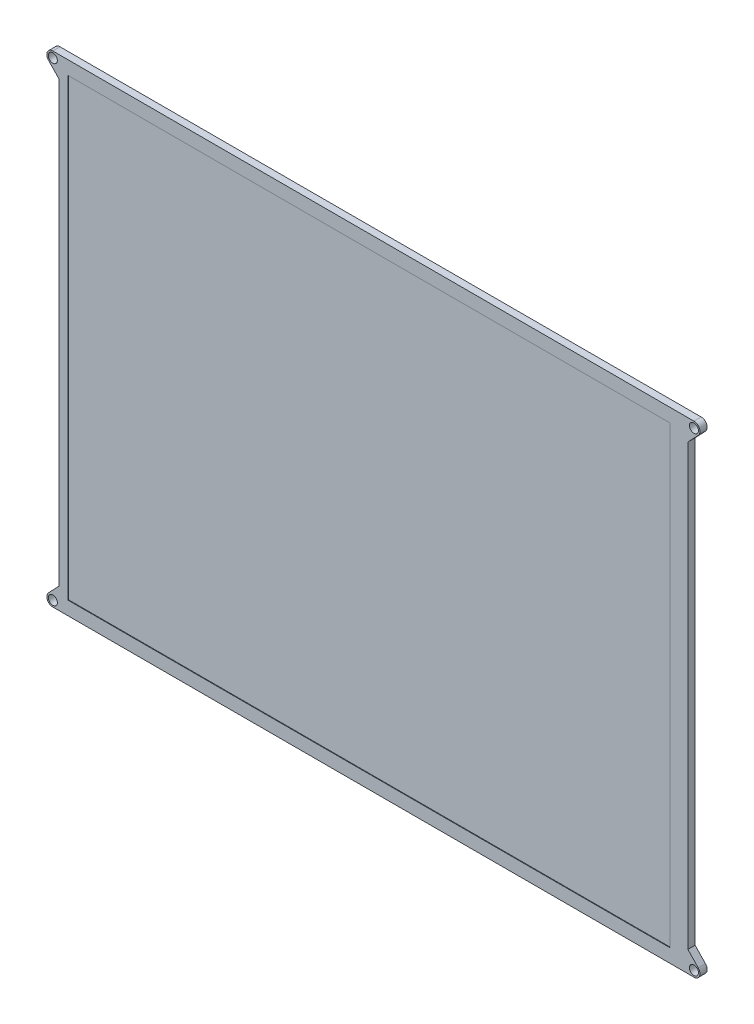
ISO-10303-21;
HEADER;
FILE_DESCRIPTION(('STEP AP214'),'2;1');
FILE_NAME('part.step','',(''),(''),'','','');
FILE_SCHEMA(('AUTOMOTIVE_DESIGN { 1 0 10303 214 1 1 1 1 }'));
ENDSEC;
DATA;
#1=APPLICATION_CONTEXT('core data for automotive mechanical design processes');
#2=APPLICATION_PROTOCOL_DEFINITION('international standard','automotive_design',2000,#1);
#3=PRODUCT_CONTEXT('',#1,'mechanical');
#4=PRODUCT('Part','Part','',(#3));
#5=PRODUCT_RELATED_PRODUCT_CATEGORY('part','',(#4));
#6=PRODUCT_DEFINITION_FORMATION('','',#4);
#7=PRODUCT_DEFINITION_CONTEXT('part definition',#1,'design');
#8=PRODUCT_DEFINITION('design','',#6,#7);
#9=PRODUCT_DEFINITION_SHAPE('','',#8);
#10=(LENGTH_UNIT() NAMED_UNIT(*) SI_UNIT(.MILLI.,.METRE.));
#11=(NAMED_UNIT(*) PLANE_ANGLE_UNIT() SI_UNIT($,.RADIAN.));
#12=(NAMED_UNIT(*) SI_UNIT($,.STERADIAN.) SOLID_ANGLE_UNIT());
#13=UNCERTAINTY_MEASURE_WITH_UNIT(LENGTH_MEASURE(1.E-05),#10,'distance_accuracy_value','');
#14=(GEOMETRIC_REPRESENTATION_CONTEXT(3) GLOBAL_UNCERTAINTY_ASSIGNED_CONTEXT((#13)) GLOBAL_UNIT_ASSIGNED_CONTEXT((#10,
#11,#12)) REPRESENTATION_CONTEXT('',''));
#15=CARTESIAN_POINT('',(0.,0.,0.));
#16=DIRECTION('',(0.,0.,1.));
#17=DIRECTION('',(1.,0.,0.));
#18=AXIS2_PLACEMENT_3D('',#15,#16,#17);
#19=CARTESIAN_POINT('',(104.5,0.,2.4));
#20=DIRECTION('',(1.,0.,0.));
#21=DIRECTION('',(0.,0.,-1.));
#22=AXIS2_PLACEMENT_3D('',#19,#20,#21);
#23=PLANE('',#22);
#24=DIRECTION('',(0.,-1.,0.));
#25=VECTOR('',#24,1.);
#26=CARTESIAN_POINT('',(104.5,0.,0.));
#27=LINE('',#26,#25);
#28=CARTESIAN_POINT('',(104.5,73.0000000000001,0.));
#29=VERTEX_POINT('',#28);
#30=CARTESIAN_POINT('',(104.5,-73.0000000000001,0.));
#31=VERTEX_POINT('',#30);
#32=EDGE_CURVE('E177',#29,#31,#27,.T.);
#33=ORIENTED_EDGE('',*,*,#32,.F.);
#34=DIRECTION('',(0.,0.,-1.));
#35=VECTOR('',#34,1.);
#36=CARTESIAN_POINT('',(104.5,73.0000000000001,2.4));
#37=LINE('',#36,#35);
#38=CARTESIAN_POINT('',(104.5,73.0000000000001,2.4));
#39=VERTEX_POINT('',#38);
#40=EDGE_CURVE('E11',#39,#29,#37,.T.);
#41=ORIENTED_EDGE('',*,*,#40,.F.);
#42=DIRECTION('',(0.,-1.,0.));
#43=VECTOR('',#42,1.);
#44=CARTESIAN_POINT('',(104.5,0.,2.4));
#45=LINE('',#44,#43);
#46=CARTESIAN_POINT('',(104.5,-73.0000000000001,2.4));
#47=VERTEX_POINT('',#46);
#48=EDGE_CURVE('E218',#39,#47,#45,.T.);
#49=ORIENTED_EDGE('',*,*,#48,.T.);
#50=DIRECTION('',(0.,0.,-1.));
#51=VECTOR('',#50,1.);
#52=CARTESIAN_POINT('',(104.5,-73.0000000000001,2.4));
#53=LINE('',#52,#51);
#54=EDGE_CURVE('E56',#47,#31,#53,.T.);
#55=ORIENTED_EDGE('',*,*,#54,.T.);
#56=EDGE_LOOP('',(#33,#41,#49,#55));
#57=FACE_BOUND('',#56,.T.);
#58=ADVANCED_FACE('F33',(#57),#23,.T.);
#59=CARTESIAN_POINT('',(18.3406658739592,-17.4673008323422,2.4));
#60=DIRECTION('',(-0.724137931034481,0.689655172413795,0.));
#61=DIRECTION('',(-0.689655172413795,-0.724137931034481,0.));
#62=AXIS2_PLACEMENT_3D('',#59,#60,#61);
#63=PLANE('',#62);
#64=DIRECTION('',(0.689655172413795,0.724137931034481,0.));
#65=VECTOR('',#64,1.);
#66=CARTESIAN_POINT('',(18.3406658739592,-17.4673008323422,0.));
#67=LINE('',#66,#65);
#68=CARTESIAN_POINT('',(107.948275862069,76.6206896551725,0.));
#69=VERTEX_POINT('',#68);
#70=EDGE_CURVE('E179',#29,#69,#67,.T.);
#71=ORIENTED_EDGE('',*,*,#70,.T.);
#72=DIRECTION('',(0.,0.,-1.));
#73=VECTOR('',#72,1.);
#74=CARTESIAN_POINT('',(107.948275862069,76.6206896551725,2.4));
#75=LINE('',#74,#73);
#76=CARTESIAN_POINT('',(107.948275862069,76.6206896551725,2.4));
#77=VERTEX_POINT('',#76);
#78=EDGE_CURVE('E40',#77,#69,#75,.T.);
#79=ORIENTED_EDGE('',*,*,#78,.F.);
#80=DIRECTION('',(0.689655172413795,0.724137931034481,0.));
#81=VECTOR('',#80,1.);
#82=CARTESIAN_POINT('',(18.3406658739592,-17.4673008323422,2.4));
#83=LINE('',#82,#81);
#84=EDGE_CURVE('E261',#39,#77,#83,.T.);
#85=ORIENTED_EDGE('',*,*,#84,.F.);
#86=ORIENTED_EDGE('',*,*,#40,.T.);
#87=EDGE_LOOP('',(#71,#79,#85,#86));
#88=FACE_BOUND('',#87,.T.);
#89=ADVANCED_FACE('F354',(#88),#63,.F.);
#90=CARTESIAN_POINT('',(106.5,78.,2.4));
#91=DIRECTION('',(0.,0.,-1.));
#92=DIRECTION('',(-1.,0.,0.));
#93=AXIS2_PLACEMENT_3D('',#90,#91,#92);
#94=CYLINDRICAL_SURFACE('',#93,1.99999999999998);
#95=CARTESIAN_POINT('',(106.5,78.,0.));
#96=DIRECTION('',(0.,0.,1.));
#97=DIRECTION('',(1.,0.,0.));
#98=AXIS2_PLACEMENT_3D('',#95,#96,#97);
#99=CIRCLE('',#98,1.99999999999998);
#100=CARTESIAN_POINT('',(106.5,80.,0.));
#101=VERTEX_POINT('',#100);
#102=EDGE_CURVE('E182',#69,#101,#99,.T.);
#103=ORIENTED_EDGE('',*,*,#102,.T.);
#104=DIRECTION('',(0.,0.,-1.));
#105=VECTOR('',#104,1.);
#106=CARTESIAN_POINT('',(106.5,80.,2.4));
#107=LINE('',#106,#105);
#108=CARTESIAN_POINT('',(106.5,80.,2.4));
#109=VERTEX_POINT('',#108);
#110=EDGE_CURVE('E234',#109,#101,#107,.T.);
#111=ORIENTED_EDGE('',*,*,#110,.F.);
#112=CARTESIAN_POINT('',(106.5,78.,2.4));
#113=DIRECTION('',(0.,0.,1.));
#114=DIRECTION('',(1.,0.,0.));
#115=AXIS2_PLACEMENT_3D('',#112,#113,#114);
#116=CIRCLE('',#115,1.99999999999998);
#117=EDGE_CURVE('E242',#77,#109,#116,.T.);
#118=ORIENTED_EDGE('',*,*,#117,.F.);
#119=ORIENTED_EDGE('',*,*,#78,.T.);
#120=EDGE_LOOP('',(#103,#111,#118,#119));
#121=FACE_BOUND('',#120,.T.);
#122=ADVANCED_FACE('F240',(#121),#94,.T.);
#123=CARTESIAN_POINT('',(0.,80.,2.4));
#124=DIRECTION('',(0.,1.,0.));
#125=DIRECTION('',(0.,0.,1.));
#126=AXIS2_PLACEMENT_3D('',#123,#124,#125);
#127=PLANE('',#126);
#128=DIRECTION('',(1.,0.,0.));
#129=VECTOR('',#128,1.);
#130=CARTESIAN_POINT('',(0.,80.,0.));
#131=LINE('',#130,#129);
#132=CARTESIAN_POINT('',(-106.5,79.9999999999985,0.));
#133=VERTEX_POINT('',#132);
#134=EDGE_CURVE('E185',#133,#101,#131,.T.);
#135=ORIENTED_EDGE('',*,*,#134,.F.);
#136=DIRECTION('',(0.,0.,-1.));
#137=VECTOR('',#136,1.);
#138=CARTESIAN_POINT('',(-106.5,79.9999999999985,2.4));
#139=LINE('',#138,#137);
#140=CARTESIAN_POINT('',(-106.5,79.9999999999985,2.4));
#141=VERTEX_POINT('',#140);
#142=EDGE_CURVE('E232',#141,#133,#139,.T.);
#143=ORIENTED_EDGE('',*,*,#142,.F.);
#144=DIRECTION('',(1.,0.,0.));
#145=VECTOR('',#144,1.);
#146=CARTESIAN_POINT('',(0.,80.,2.4));
#147=LINE('',#146,#145);
#148=EDGE_CURVE('E254',#141,#109,#147,.T.);
#149=ORIENTED_EDGE('',*,*,#148,.T.);
#150=ORIENTED_EDGE('',*,*,#110,.T.);
#151=EDGE_LOOP('',(#135,#143,#149,#150));
#152=FACE_BOUND('',#151,.T.);
#153=ADVANCED_FACE('F251',(#152),#127,.T.);
#154=CARTESIAN_POINT('',(-106.5,78.,2.4));
#155=DIRECTION('',(0.,0.,-1.));
#156=DIRECTION('',(-1.,0.,0.));
#157=AXIS2_PLACEMENT_3D('',#154,#155,#156);
#158=CYLINDRICAL_SURFACE('',#157,1.99999999999975);
#159=CARTESIAN_POINT('',(-106.5,78.,0.));
#160=DIRECTION('',(0.,0.,1.));
#161=DIRECTION('',(1.,0.,0.));
#162=AXIS2_PLACEMENT_3D('',#159,#160,#161);
#163=CIRCLE('',#162,1.99999999999975);
#164=CARTESIAN_POINT('',(-107.948275862069,76.6206896551709,0.));
#165=VERTEX_POINT('',#164);
#166=EDGE_CURVE('E188',#165,#133,#163,.F.);
#167=ORIENTED_EDGE('',*,*,#166,.F.);
#168=DIRECTION('',(0.,0.,-1.));
#169=VECTOR('',#168,1.);
#170=CARTESIAN_POINT('',(-107.948275862069,76.6206896551709,2.4));
#171=LINE('',#170,#169);
#172=CARTESIAN_POINT('',(-107.948275862069,76.6206896551709,2.4));
#173=VERTEX_POINT('',#172);
#174=EDGE_CURVE('E230',#173,#165,#171,.T.);
#175=ORIENTED_EDGE('',*,*,#174,.F.);
#176=CARTESIAN_POINT('',(-106.5,78.,2.4));
#177=DIRECTION('',(0.,0.,1.));
#178=DIRECTION('',(1.,0.,0.));
#179=AXIS2_PLACEMENT_3D('',#176,#177,#178);
#180=CIRCLE('',#179,1.99999999999975);
#181=EDGE_CURVE('E257',#173,#141,#180,.F.);
#182=ORIENTED_EDGE('',*,*,#181,.T.);
#183=ORIENTED_EDGE('',*,*,#142,.T.);
#184=EDGE_LOOP('',(#167,#175,#182,#183));
#185=FACE_BOUND('',#184,.T.);
#186=ADVANCED_FACE('F365',(#185),#158,.T.);
#187=CARTESIAN_POINT('',(-18.3406658739582,-17.4673008323418,2.4));
#188=DIRECTION('',(-0.72413793103447,-0.689655172413807,0.));
#189=DIRECTION('',(0.689655172413807,-0.72413793103447,0.));
#190=AXIS2_PLACEMENT_3D('',#187,#188,#189);
#191=PLANE('',#190);
#192=DIRECTION('',(-0.689655172413807,0.72413793103447,0.));
#193=VECTOR('',#192,1.);
#194=CARTESIAN_POINT('',(-18.3406658739582,-17.4673008323418,0.));
#195=LINE('',#194,#193);
#196=CARTESIAN_POINT('',(-104.5,72.9999999999987,0.));
#197=VERTEX_POINT('',#196);
#198=EDGE_CURVE('E191',#197,#165,#195,.T.);
#199=ORIENTED_EDGE('',*,*,#198,.F.);
#200=DIRECTION('',(0.,0.,-1.));
#201=VECTOR('',#200,1.);
#202=CARTESIAN_POINT('',(-104.5,72.9999999999987,2.4));
#203=LINE('',#202,#201);
#204=CARTESIAN_POINT('',(-104.5,72.9999999999987,2.4));
#205=VERTEX_POINT('',#204);
#206=EDGE_CURVE('E228',#205,#197,#203,.T.);
#207=ORIENTED_EDGE('',*,*,#206,.F.);
#208=DIRECTION('',(-0.689655172413807,0.72413793103447,0.));
#209=VECTOR('',#208,1.);
#210=CARTESIAN_POINT('',(-18.3406658739582,-17.4673008323418,2.4));
#211=LINE('',#210,#209);
#212=EDGE_CURVE('E259',#205,#173,#211,.T.);
#213=ORIENTED_EDGE('',*,*,#212,.T.);
#214=ORIENTED_EDGE('',*,*,#174,.T.);
#215=EDGE_LOOP('',(#199,#207,#213,#214));
#216=FACE_BOUND('',#215,.T.);
#217=ADVANCED_FACE('F368',(#216),#191,.T.);
#218=CARTESIAN_POINT('',(-104.5,0.,2.4));
#219=DIRECTION('',(1.,0.,0.));
#220=DIRECTION('',(0.,1.,0.));
#221=AXIS2_PLACEMENT_3D('',#218,#219,#220);
#222=PLANE('',#221);
#223=DIRECTION('',(0.,-1.,0.));
#224=VECTOR('',#223,1.);
#225=CARTESIAN_POINT('',(-104.5,0.,0.));
#226=LINE('',#225,#224);
#227=CARTESIAN_POINT('',(-104.5,-72.9999999999986,0.));
#228=VERTEX_POINT('',#227);
#229=EDGE_CURVE('E194',#197,#228,#226,.T.);
#230=ORIENTED_EDGE('',*,*,#229,.T.);
#231=DIRECTION('',(0.,0.,-1.));
#232=VECTOR('',#231,1.);
#233=CARTESIAN_POINT('',(-104.5,-72.9999999999986,2.4));
#234=LINE('',#233,#232);
#235=CARTESIAN_POINT('',(-104.5,-72.9999999999986,2.4));
#236=VERTEX_POINT('',#235);
#237=EDGE_CURVE('E225',#236,#228,#234,.T.);
#238=ORIENTED_EDGE('',*,*,#237,.F.);
#239=DIRECTION('',(0.,-1.,0.));
#240=VECTOR('',#239,1.);
#241=CARTESIAN_POINT('',(-104.5,0.,2.4));
#242=LINE('',#241,#240);
#243=EDGE_CURVE('E267',#205,#236,#242,.T.);
#244=ORIENTED_EDGE('',*,*,#243,.F.);
#245=ORIENTED_EDGE('',*,*,#206,.T.);
#246=EDGE_LOOP('',(#230,#238,#244,#245));
#247=FACE_BOUND('',#246,.T.);
#248=ADVANCED_FACE('F372',(#247),#222,.F.);
#249=CARTESIAN_POINT('',(-18.3406658739582,17.4673008323418,2.4));
#250=DIRECTION('',(0.72413793103447,-0.689655172413807,0.));
#251=DIRECTION('',(0.689655172413807,0.72413793103447,0.));
#252=AXIS2_PLACEMENT_3D('',#249,#250,#251);
#253=PLANE('',#252);
#254=DIRECTION('',(-0.689655172413807,-0.72413793103447,0.));
#255=VECTOR('',#254,1.);
#256=CARTESIAN_POINT('',(-18.3406658739582,17.4673008323418,0.));
#257=LINE('',#256,#255);
#258=CARTESIAN_POINT('',(-107.948275862069,-76.6206896551709,0.));
#259=VERTEX_POINT('',#258);
#260=EDGE_CURVE('E196',#228,#259,#257,.T.);
#261=ORIENTED_EDGE('',*,*,#260,.T.);
#262=DIRECTION('',(0.,0.,-1.));
#263=VECTOR('',#262,1.);
#264=CARTESIAN_POINT('',(-107.948275862069,-76.6206896551709,2.4));
#265=LINE('',#264,#263);
#266=CARTESIAN_POINT('',(-107.948275862069,-76.6206896551709,2.4));
#267=VERTEX_POINT('',#266);
#268=EDGE_CURVE('E222',#267,#259,#265,.T.);
#269=ORIENTED_EDGE('',*,*,#268,.F.);
#270=DIRECTION('',(-0.689655172413807,-0.72413793103447,0.));
#271=VECTOR('',#270,1.);
#272=CARTESIAN_POINT('',(-18.3406658739582,17.4673008323418,2.4));
#273=LINE('',#272,#271);
#274=EDGE_CURVE('E269',#236,#267,#273,.T.);
#275=ORIENTED_EDGE('',*,*,#274,.F.);
#276=ORIENTED_EDGE('',*,*,#237,.T.);
#277=EDGE_LOOP('',(#261,#269,#275,#276));
#278=FACE_BOUND('',#277,.T.);
#279=ADVANCED_FACE('F276',(#278),#253,.F.);
#280=CARTESIAN_POINT('',(-106.5,-78.,2.4));
#281=DIRECTION('',(0.,0.,-1.));
#282=DIRECTION('',(-1.,0.,0.));
#283=AXIS2_PLACEMENT_3D('',#280,#281,#282);
#284=CYLINDRICAL_SURFACE('',#283,1.99999999999975);
#285=CARTESIAN_POINT('',(-106.5,-78.,0.));
#286=DIRECTION('',(0.,0.,1.));
#287=DIRECTION('',(1.,0.,0.));
#288=AXIS2_PLACEMENT_3D('',#285,#286,#287);
#289=CIRCLE('',#288,1.99999999999975);
#290=CARTESIAN_POINT('',(-106.5,-79.9999999999985,0.));
#291=VERTEX_POINT('',#290);
#292=EDGE_CURVE('E198',#259,#291,#289,.T.);
#293=ORIENTED_EDGE('',*,*,#292,.T.);
#294=DIRECTION('',(0.,0.,-1.));
#295=VECTOR('',#294,1.);
#296=CARTESIAN_POINT('',(-106.5,-79.9999999999985,2.4));
#297=LINE('',#296,#295);
#298=CARTESIAN_POINT('',(-106.5,-79.9999999999985,2.4));
#299=VERTEX_POINT('',#298);
#300=EDGE_CURVE('E156',#299,#291,#297,.T.);
#301=ORIENTED_EDGE('',*,*,#300,.F.);
#302=CARTESIAN_POINT('',(-106.5,-78.,2.4));
#303=DIRECTION('',(0.,0.,1.));
#304=DIRECTION('',(1.,0.,0.));
#305=AXIS2_PLACEMENT_3D('',#302,#303,#304);
#306=CIRCLE('',#305,1.99999999999975);
#307=EDGE_CURVE('E143',#267,#299,#306,.T.);
#308=ORIENTED_EDGE('',*,*,#307,.F.);
#309=ORIENTED_EDGE('',*,*,#268,.T.);
#310=EDGE_LOOP('',(#293,#301,#308,#309));
#311=FACE_BOUND('',#310,.T.);
#312=ADVANCED_FACE('F280',(#311),#284,.T.);
#313=CARTESIAN_POINT('',(0.,-80.,2.4));
#314=DIRECTION('',(0.,1.,0.));
#315=DIRECTION('',(0.,0.,1.));
#316=AXIS2_PLACEMENT_3D('',#313,#314,#315);
#317=PLANE('',#316);
#318=DIRECTION('',(1.,0.,0.));
#319=VECTOR('',#318,1.);
#320=CARTESIAN_POINT('',(0.,-80.,0.));
#321=LINE('',#320,#319);
#322=CARTESIAN_POINT('',(106.5,-80.,0.));
#323=VERTEX_POINT('',#322);
#324=EDGE_CURVE('E152',#291,#323,#321,.T.);
#325=ORIENTED_EDGE('',*,*,#324,.T.);
#326=DIRECTION('',(0.,0.,-1.));
#327=VECTOR('',#326,1.);
#328=CARTESIAN_POINT('',(106.5,-80.,2.4));
#329=LINE('',#328,#327);
#330=CARTESIAN_POINT('',(106.5,-80.,2.4));
#331=VERTEX_POINT('',#330);
#332=EDGE_CURVE('E149',#331,#323,#329,.T.);
#333=ORIENTED_EDGE('',*,*,#332,.F.);
#334=DIRECTION('',(1.,0.,0.));
#335=VECTOR('',#334,1.);
#336=CARTESIAN_POINT('',(0.,-80.,2.4));
#337=LINE('',#336,#335);
#338=EDGE_CURVE('E134',#299,#331,#337,.T.);
#339=ORIENTED_EDGE('',*,*,#338,.F.);
#340=ORIENTED_EDGE('',*,*,#300,.T.);
#341=EDGE_LOOP('',(#325,#333,#339,#340));
#342=FACE_BOUND('',#341,.T.);
#343=ADVANCED_FACE('F150',(#342),#317,.F.);
#344=CARTESIAN_POINT('',(106.5,-78.,2.4));
#345=DIRECTION('',(0.,0.,-1.));
#346=DIRECTION('',(-1.,0.,0.));
#347=AXIS2_PLACEMENT_3D('',#344,#345,#346);
#348=CYLINDRICAL_SURFACE('',#347,1.99999999999998);
#349=CARTESIAN_POINT('',(106.5,-78.,0.));
#350=DIRECTION('',(0.,0.,1.));
#351=DIRECTION('',(1.,0.,0.));
#352=AXIS2_PLACEMENT_3D('',#349,#350,#351);
#353=CIRCLE('',#352,1.99999999999998);
#354=CARTESIAN_POINT('',(107.948275862069,-76.6206896551725,0.));
#355=VERTEX_POINT('',#354);
#356=EDGE_CURVE('E201',#355,#323,#353,.F.);
#357=ORIENTED_EDGE('',*,*,#356,.F.);
#358=DIRECTION('',(0.,0.,-1.));
#359=VECTOR('',#358,1.);
#360=CARTESIAN_POINT('',(107.948275862069,-76.6206896551725,2.4));
#361=LINE('',#360,#359);
#362=CARTESIAN_POINT('',(107.948275862069,-76.6206896551725,2.4));
#363=VERTEX_POINT('',#362);
#364=EDGE_CURVE('E157',#363,#355,#361,.T.);
#365=ORIENTED_EDGE('',*,*,#364,.F.);
#366=CARTESIAN_POINT('',(106.5,-78.,2.4));
#367=DIRECTION('',(0.,0.,1.));
#368=DIRECTION('',(1.,0.,0.));
#369=AXIS2_PLACEMENT_3D('',#366,#367,#368);
#370=CIRCLE('',#369,1.99999999999998);
#371=EDGE_CURVE('E141',#363,#331,#370,.F.);
#372=ORIENTED_EDGE('',*,*,#371,.T.);
#373=ORIENTED_EDGE('',*,*,#332,.T.);
#374=EDGE_LOOP('',(#357,#365,#372,#373));
#375=FACE_BOUND('',#374,.T.);
#376=ADVANCED_FACE('F159',(#375),#348,.T.);
#377=CARTESIAN_POINT('',(106.5,-78.,2.4));
#378=DIRECTION('',(0.,0.,-1.));
#379=DIRECTION('',(-1.,0.,0.));
#380=AXIS2_PLACEMENT_3D('',#377,#378,#379);
#381=CYLINDRICAL_SURFACE('',#380,1.5);
#382=CARTESIAN_POINT('',(106.5,-78.,2.4));
#383=DIRECTION('',(0.,0.,1.));
#384=DIRECTION('',(1.,0.,0.));
#385=AXIS2_PLACEMENT_3D('',#382,#383,#384);
#386=CIRCLE('',#385,1.5);
#387=CARTESIAN_POINT('',(108.,-78.,2.4));
#388=VERTEX_POINT('',#387);
#389=EDGE_CURVE('E171',#388,#388,#386,.F.);
#390=ORIENTED_EDGE('',*,*,#389,.F.);
#391=EDGE_LOOP('',(#390));
#392=FACE_BOUND('',#391,.T.);
#393=CARTESIAN_POINT('',(106.5,-78.,0.));
#394=DIRECTION('',(0.,0.,1.));
#395=DIRECTION('',(1.,0.,0.));
#396=AXIS2_PLACEMENT_3D('',#393,#394,#395);
#397=CIRCLE('',#396,1.5);
#398=CARTESIAN_POINT('',(108.,-78.,0.));
#399=VERTEX_POINT('',#398);
#400=EDGE_CURVE('E212',#399,#399,#397,.F.);
#401=ORIENTED_EDGE('',*,*,#400,.T.);
#402=EDGE_LOOP('',(#401));
#403=FACE_BOUND('',#402,.T.);
#404=ADVANCED_FACE('F385',(#392,#403),#381,.F.);
#405=CARTESIAN_POINT('',(-106.5,78.,2.4));
#406=DIRECTION('',(0.,0.,-1.));
#407=DIRECTION('',(-1.,0.,0.));
#408=AXIS2_PLACEMENT_3D('',#405,#406,#407);
#409=CYLINDRICAL_SURFACE('',#408,1.49999999999956);
#410=CARTESIAN_POINT('',(-106.5,78.,2.4));
#411=DIRECTION('',(0.,0.,1.));
#412=DIRECTION('',(1.,0.,0.));
#413=AXIS2_PLACEMENT_3D('',#410,#411,#412);
#414=CIRCLE('',#413,1.49999999999956);
#415=CARTESIAN_POINT('',(-105.,78.,2.4));
#416=VERTEX_POINT('',#415);
#417=EDGE_CURVE('E168',#416,#416,#414,.F.);
#418=ORIENTED_EDGE('',*,*,#417,.F.);
#419=EDGE_LOOP('',(#418));
#420=FACE_BOUND('',#419,.T.);
#421=CARTESIAN_POINT('',(-106.5,78.,0.));
#422=DIRECTION('',(0.,0.,1.));
#423=DIRECTION('',(1.,0.,0.));
#424=AXIS2_PLACEMENT_3D('',#421,#422,#423);
#425=CIRCLE('',#424,1.49999999999956);
#426=CARTESIAN_POINT('',(-105.,78.,0.));
#427=VERTEX_POINT('',#426);
#428=EDGE_CURVE('E209',#427,#427,#425,.F.);
#429=ORIENTED_EDGE('',*,*,#428,.T.);
#430=EDGE_LOOP('',(#429));
#431=FACE_BOUND('',#430,.T.);
#432=ADVANCED_FACE('F392',(#420,#431),#409,.F.);
#433=CARTESIAN_POINT('',(-106.5,-78.,2.4));
#434=DIRECTION('',(0.,0.,-1.));
#435=DIRECTION('',(-1.,0.,0.));
#436=AXIS2_PLACEMENT_3D('',#433,#434,#435);
#437=CYLINDRICAL_SURFACE('',#436,1.49999999999956);
#438=CARTESIAN_POINT('',(-106.5,-78.,2.4));
#439=DIRECTION('',(0.,0.,1.));
#440=DIRECTION('',(1.,0.,0.));
#441=AXIS2_PLACEMENT_3D('',#438,#439,#440);
#442=CIRCLE('',#441,1.49999999999956);
#443=CARTESIAN_POINT('',(-105.,-78.,2.4));
#444=VERTEX_POINT('',#443);
#445=EDGE_CURVE('E162',#444,#444,#442,.T.);
#446=ORIENTED_EDGE('',*,*,#445,.T.);
#447=EDGE_LOOP('',(#446));
#448=FACE_BOUND('',#447,.T.);
#449=CARTESIAN_POINT('',(-106.5,-78.,0.));
#450=DIRECTION('',(0.,0.,1.));
#451=DIRECTION('',(1.,0.,0.));
#452=AXIS2_PLACEMENT_3D('',#449,#450,#451);
#453=CIRCLE('',#452,1.49999999999956);
#454=CARTESIAN_POINT('',(-105.,-78.,0.));
#455=VERTEX_POINT('',#454);
#456=EDGE_CURVE('E206',#455,#455,#453,.T.);
#457=ORIENTED_EDGE('',*,*,#456,.F.);
#458=EDGE_LOOP('',(#457));
#459=FACE_BOUND('',#458,.T.);
#460=ADVANCED_FACE('F389',(#448,#459),#437,.F.);
#461=CARTESIAN_POINT('',(18.3406658739592,17.4673008323422,2.4));
#462=DIRECTION('',(0.724137931034481,0.689655172413795,0.));
#463=DIRECTION('',(-0.689655172413795,0.724137931034481,0.));
#464=AXIS2_PLACEMENT_3D('',#461,#462,#463);
#465=PLANE('',#464);
#466=DIRECTION('',(0.689655172413795,-0.724137931034481,0.));
#467=VECTOR('',#466,1.);
#468=CARTESIAN_POINT('',(18.3406658739592,17.4673008323422,0.));
#469=LINE('',#468,#467);
#470=EDGE_CURVE('E203',#31,#355,#469,.T.);
#471=ORIENTED_EDGE('',*,*,#470,.F.);
#472=ORIENTED_EDGE('',*,*,#54,.F.);
#473=DIRECTION('',(0.689655172413795,-0.724137931034481,0.));
#474=VECTOR('',#473,1.);
#475=CARTESIAN_POINT('',(18.3406658739592,17.4673008323422,2.4));
#476=LINE('',#475,#474);
#477=EDGE_CURVE('E160',#47,#363,#476,.T.);
#478=ORIENTED_EDGE('',*,*,#477,.T.);
#479=ORIENTED_EDGE('',*,*,#364,.T.);
#480=EDGE_LOOP('',(#471,#472,#478,#479));
#481=FACE_BOUND('',#480,.T.);
#482=ADVANCED_FACE('F281',(#481),#465,.T.);
#483=CARTESIAN_POINT('',(106.5,78.,2.4));
#484=DIRECTION('',(0.,0.,-1.));
#485=DIRECTION('',(-1.,0.,0.));
#486=AXIS2_PLACEMENT_3D('',#483,#484,#485);
#487=CYLINDRICAL_SURFACE('',#486,1.5);
#488=CARTESIAN_POINT('',(106.5,78.,2.4));
#489=DIRECTION('',(0.,0.,1.));
#490=DIRECTION('',(1.,0.,0.));
#491=AXIS2_PLACEMENT_3D('',#488,#489,#490);
#492=CIRCLE('',#491,1.5);
#493=CARTESIAN_POINT('',(108.,78.,2.4));
#494=VERTEX_POINT('',#493);
#495=EDGE_CURVE('E174',#494,#494,#492,.T.);
#496=ORIENTED_EDGE('',*,*,#495,.T.);
#497=EDGE_LOOP('',(#496));
#498=FACE_BOUND('',#497,.T.);
#499=CARTESIAN_POINT('',(106.5,78.,0.));
#500=DIRECTION('',(0.,0.,1.));
#501=DIRECTION('',(1.,0.,0.));
#502=AXIS2_PLACEMENT_3D('',#499,#500,#501);
#503=CIRCLE('',#502,1.5);
#504=CARTESIAN_POINT('',(108.,78.,0.));
#505=VERTEX_POINT('',#504);
#506=EDGE_CURVE('E215',#505,#505,#503,.T.);
#507=ORIENTED_EDGE('',*,*,#506,.F.);
#508=EDGE_LOOP('',(#507));
#509=FACE_BOUND('',#508,.T.);
#510=ADVANCED_FACE('F388',(#498,#509),#487,.F.);
#511=CARTESIAN_POINT('',(0.,0.,2.4));
#512=DIRECTION('',(0.,0.,1.));
#513=DIRECTION('',(1.,0.,0.));
#514=AXIS2_PLACEMENT_3D('',#511,#512,#513);
#515=PLANE('',#514);
#516=DIRECTION('',(0.,1.,0.));
#517=VECTOR('',#516,1.);
#518=CARTESIAN_POINT('',(98.4999999999999,75.5,2.4));
#519=LINE('',#518,#517);
#520=CARTESIAN_POINT('',(98.5,-75.5,2.4));
#521=VERTEX_POINT('',#520);
#522=CARTESIAN_POINT('',(98.4999999999999,75.5,2.4));
#523=VERTEX_POINT('',#522);
#524=EDGE_CURVE('E47',#521,#523,#519,.T.);
#525=ORIENTED_EDGE('',*,*,#524,.F.);
#526=DIRECTION('',(1.,0.,0.));
#527=VECTOR('',#526,1.);
#528=CARTESIAN_POINT('',(-101.5,-75.5,2.4));
#529=LINE('',#528,#527);
#530=CARTESIAN_POINT('',(-101.5,-75.5,2.4));
#531=VERTEX_POINT('',#530);
#532=EDGE_CURVE('E294',#531,#521,#529,.T.);
#533=ORIENTED_EDGE('',*,*,#532,.F.);
#534=DIRECTION('',(0.,-1.,0.));
#535=VECTOR('',#534,1.);
#536=CARTESIAN_POINT('',(-101.5,75.5,2.4));
#537=LINE('',#536,#535);
#538=CARTESIAN_POINT('',(-101.5,75.5,2.4));
#539=VERTEX_POINT('',#538);
#540=EDGE_CURVE('E298',#539,#531,#537,.T.);
#541=ORIENTED_EDGE('',*,*,#540,.F.);
#542=DIRECTION('',(-1.,0.,0.));
#543=VECTOR('',#542,1.);
#544=CARTESIAN_POINT('',(-101.5,75.5,2.4));
#545=LINE('',#544,#543);
#546=EDGE_CURVE('E301',#523,#539,#545,.T.);
#547=ORIENTED_EDGE('',*,*,#546,.F.);
#548=EDGE_LOOP('',(#525,#533,#541,#547));
#549=FACE_BOUND('',#548,.T.);
#550=ORIENTED_EDGE('',*,*,#48,.F.);
#551=ORIENTED_EDGE('',*,*,#84,.T.);
#552=ORIENTED_EDGE('',*,*,#117,.T.);
#553=ORIENTED_EDGE('',*,*,#148,.F.);
#554=ORIENTED_EDGE('',*,*,#181,.F.);
#555=ORIENTED_EDGE('',*,*,#212,.F.);
#556=ORIENTED_EDGE('',*,*,#243,.T.);
#557=ORIENTED_EDGE('',*,*,#274,.T.);
#558=ORIENTED_EDGE('',*,*,#307,.T.);
#559=ORIENTED_EDGE('',*,*,#338,.T.);
#560=ORIENTED_EDGE('',*,*,#371,.F.);
#561=ORIENTED_EDGE('',*,*,#477,.F.);
#562=EDGE_LOOP('',(#550,#551,#552,#553,#554,#555,#556,#557,#558,#559,#560,#561));
#563=FACE_BOUND('',#562,.T.);
#564=ORIENTED_EDGE('',*,*,#445,.F.);
#565=EDGE_LOOP('',(#564));
#566=FACE_BOUND('',#565,.T.);
#567=ORIENTED_EDGE('',*,*,#417,.T.);
#568=EDGE_LOOP('',(#567));
#569=FACE_BOUND('',#568,.T.);
#570=ORIENTED_EDGE('',*,*,#389,.T.);
#571=EDGE_LOOP('',(#570));
#572=FACE_BOUND('',#571,.T.);
#573=ORIENTED_EDGE('',*,*,#495,.F.);
#574=EDGE_LOOP('',(#573));
#575=FACE_BOUND('',#574,.T.);
#576=ADVANCED_FACE('F137',(#549,#563,#566,#569,#572,#575),#515,.T.);
#577=CARTESIAN_POINT('',(0.,0.,0.));
#578=DIRECTION('',(0.,0.,1.));
#579=DIRECTION('',(1.,0.,0.));
#580=AXIS2_PLACEMENT_3D('',#577,#578,#579);
#581=PLANE('',#580);
#582=ORIENTED_EDGE('',*,*,#32,.T.);
#583=ORIENTED_EDGE('',*,*,#470,.T.);
#584=ORIENTED_EDGE('',*,*,#356,.T.);
#585=ORIENTED_EDGE('',*,*,#324,.F.);
#586=ORIENTED_EDGE('',*,*,#292,.F.);
#587=ORIENTED_EDGE('',*,*,#260,.F.);
#588=ORIENTED_EDGE('',*,*,#229,.F.);
#589=ORIENTED_EDGE('',*,*,#198,.T.);
#590=ORIENTED_EDGE('',*,*,#166,.T.);
#591=ORIENTED_EDGE('',*,*,#134,.T.);
#592=ORIENTED_EDGE('',*,*,#102,.F.);
#593=ORIENTED_EDGE('',*,*,#70,.F.);
#594=EDGE_LOOP('',(#582,#583,#584,#585,#586,#587,#588,#589,#590,#591,#592,#593));
#595=FACE_BOUND('',#594,.T.);
#596=ORIENTED_EDGE('',*,*,#456,.T.);
#597=EDGE_LOOP('',(#596));
#598=FACE_BOUND('',#597,.T.);
#599=ORIENTED_EDGE('',*,*,#428,.F.);
#600=EDGE_LOOP('',(#599));
#601=FACE_BOUND('',#600,.T.);
#602=ORIENTED_EDGE('',*,*,#400,.F.);
#603=EDGE_LOOP('',(#602));
#604=FACE_BOUND('',#603,.T.);
#605=ORIENTED_EDGE('',*,*,#506,.T.);
#606=EDGE_LOOP('',(#605));
#607=FACE_BOUND('',#606,.T.);
#608=ADVANCED_FACE('F246',(#595,#598,#601,#604,#607),#581,.F.);
#609=CARTESIAN_POINT('',(98.4999999999999,75.5,2.2));
#610=DIRECTION('',(1.,0.,0.));
#611=DIRECTION('',(0.,1.,0.));
#612=AXIS2_PLACEMENT_3D('',#609,#610,#611);
#613=PLANE('',#612);
#614=ORIENTED_EDGE('',*,*,#524,.T.);
#615=DIRECTION('',(0.,0.,1.));
#616=VECTOR('',#615,1.);
#617=CARTESIAN_POINT('',(98.4999999999999,75.5,2.2));
#618=LINE('',#617,#616);
#619=CARTESIAN_POINT('',(98.4999999999999,75.5,2.2));
#620=VERTEX_POINT('',#619);
#621=EDGE_CURVE('E284',#620,#523,#618,.T.);
#622=ORIENTED_EDGE('',*,*,#621,.F.);
#623=DIRECTION('',(0.,1.,0.));
#624=VECTOR('',#623,1.);
#625=CARTESIAN_POINT('',(98.4999999999999,75.5,2.2));
#626=LINE('',#625,#624);
#627=CARTESIAN_POINT('',(98.5,-75.5,2.2));
#628=VERTEX_POINT('',#627);
#629=EDGE_CURVE('E297',#628,#620,#626,.T.);
#630=ORIENTED_EDGE('',*,*,#629,.F.);
#631=DIRECTION('',(0.,0.,1.));
#632=VECTOR('',#631,1.);
#633=CARTESIAN_POINT('',(98.5,-75.5,2.2));
#634=LINE('',#633,#632);
#635=EDGE_CURVE('E180',#628,#521,#634,.T.);
#636=ORIENTED_EDGE('',*,*,#635,.T.);
#637=EDGE_LOOP('',(#614,#622,#630,#636));
#638=FACE_BOUND('',#637,.T.);
#639=ADVANCED_FACE('F322',(#638),#613,.F.);
#640=CARTESIAN_POINT('',(-101.5,-75.5,2.2));
#641=DIRECTION('',(0.,-1.,0.));
#642=DIRECTION('',(0.,0.,-1.));
#643=AXIS2_PLACEMENT_3D('',#640,#641,#642);
#644=PLANE('',#643);
#645=ORIENTED_EDGE('',*,*,#532,.T.);
#646=ORIENTED_EDGE('',*,*,#635,.F.);
#647=DIRECTION('',(1.,0.,0.));
#648=VECTOR('',#647,1.);
#649=CARTESIAN_POINT('',(-101.5,-75.5,2.2));
#650=LINE('',#649,#648);
#651=CARTESIAN_POINT('',(-101.5,-75.5,2.2));
#652=VERTEX_POINT('',#651);
#653=EDGE_CURVE('E287',#652,#628,#650,.T.);
#654=ORIENTED_EDGE('',*,*,#653,.F.);
#655=DIRECTION('',(0.,0.,1.));
#656=VECTOR('',#655,1.);
#657=CARTESIAN_POINT('',(-101.5,-75.5,2.2));
#658=LINE('',#657,#656);
#659=EDGE_CURVE('E290',#652,#531,#658,.T.);
#660=ORIENTED_EDGE('',*,*,#659,.T.);
#661=EDGE_LOOP('',(#645,#646,#654,#660));
#662=FACE_BOUND('',#661,.T.);
#663=ADVANCED_FACE('F333',(#662),#644,.F.);
#664=CARTESIAN_POINT('',(-101.5,75.5,2.2));
#665=DIRECTION('',(-1.,0.,0.));
#666=DIRECTION('',(0.,-1.,0.));
#667=AXIS2_PLACEMENT_3D('',#664,#665,#666);
#668=PLANE('',#667);
#669=ORIENTED_EDGE('',*,*,#540,.T.);
#670=ORIENTED_EDGE('',*,*,#659,.F.);
#671=DIRECTION('',(0.,-1.,0.));
#672=VECTOR('',#671,1.);
#673=CARTESIAN_POINT('',(-101.5,75.5,2.2));
#674=LINE('',#673,#672);
#675=CARTESIAN_POINT('',(-101.5,75.5,2.2));
#676=VERTEX_POINT('',#675);
#677=EDGE_CURVE('E307',#676,#652,#674,.T.);
#678=ORIENTED_EDGE('',*,*,#677,.F.);
#679=DIRECTION('',(0.,0.,1.));
#680=VECTOR('',#679,1.);
#681=CARTESIAN_POINT('',(-101.5,75.5,2.2));
#682=LINE('',#681,#680);
#683=EDGE_CURVE('E286',#676,#539,#682,.T.);
#684=ORIENTED_EDGE('',*,*,#683,.T.);
#685=EDGE_LOOP('',(#669,#670,#678,#684));
#686=FACE_BOUND('',#685,.T.);
#687=ADVANCED_FACE('F338',(#686),#668,.F.);
#688=CARTESIAN_POINT('',(-101.5,75.5,2.2));
#689=DIRECTION('',(0.,1.,0.));
#690=DIRECTION('',(0.,0.,1.));
#691=AXIS2_PLACEMENT_3D('',#688,#689,#690);
#692=PLANE('',#691);
#693=ORIENTED_EDGE('',*,*,#546,.T.);
#694=ORIENTED_EDGE('',*,*,#683,.F.);
#695=DIRECTION('',(-1.,0.,0.));
#696=VECTOR('',#695,1.);
#697=CARTESIAN_POINT('',(-101.5,75.5,2.2));
#698=LINE('',#697,#696);
#699=EDGE_CURVE('E310',#620,#676,#698,.T.);
#700=ORIENTED_EDGE('',*,*,#699,.F.);
#701=ORIENTED_EDGE('',*,*,#621,.T.);
#702=EDGE_LOOP('',(#693,#694,#700,#701));
#703=FACE_BOUND('',#702,.T.);
#704=ADVANCED_FACE('F343',(#703),#692,.F.);
#705=CARTESIAN_POINT('',(0.,0.,2.2));
#706=DIRECTION('',(0.,0.,1.));
#707=DIRECTION('',(1.,0.,0.));
#708=AXIS2_PLACEMENT_3D('',#705,#706,#707);
#709=PLANE('',#708);
#710=ORIENTED_EDGE('',*,*,#629,.T.);
#711=ORIENTED_EDGE('',*,*,#699,.T.);
#712=ORIENTED_EDGE('',*,*,#677,.T.);
#713=ORIENTED_EDGE('',*,*,#653,.T.);
#714=EDGE_LOOP('',(#710,#711,#712,#713));
#715=FACE_BOUND('',#714,.T.);
#716=ADVANCED_FACE('F317',(#715),#709,.T.);
#717=CLOSED_SHELL('',(#58,#89,#122,#153,#186,#217,#248,#279,#312,#343,#376,#404,#432,#460,#482,
#510,#576,#608,#639,#663,#687,#704,#716));
#718=MANIFOLD_SOLID_BREP('B2',#717);
#719=ADVANCED_BREP_SHAPE_REPRESENTATION('',(#18,#718),#14);
#720=SHAPE_DEFINITION_REPRESENTATION(#9,#719);
ENDSEC;
END-ISO-10303-21;
